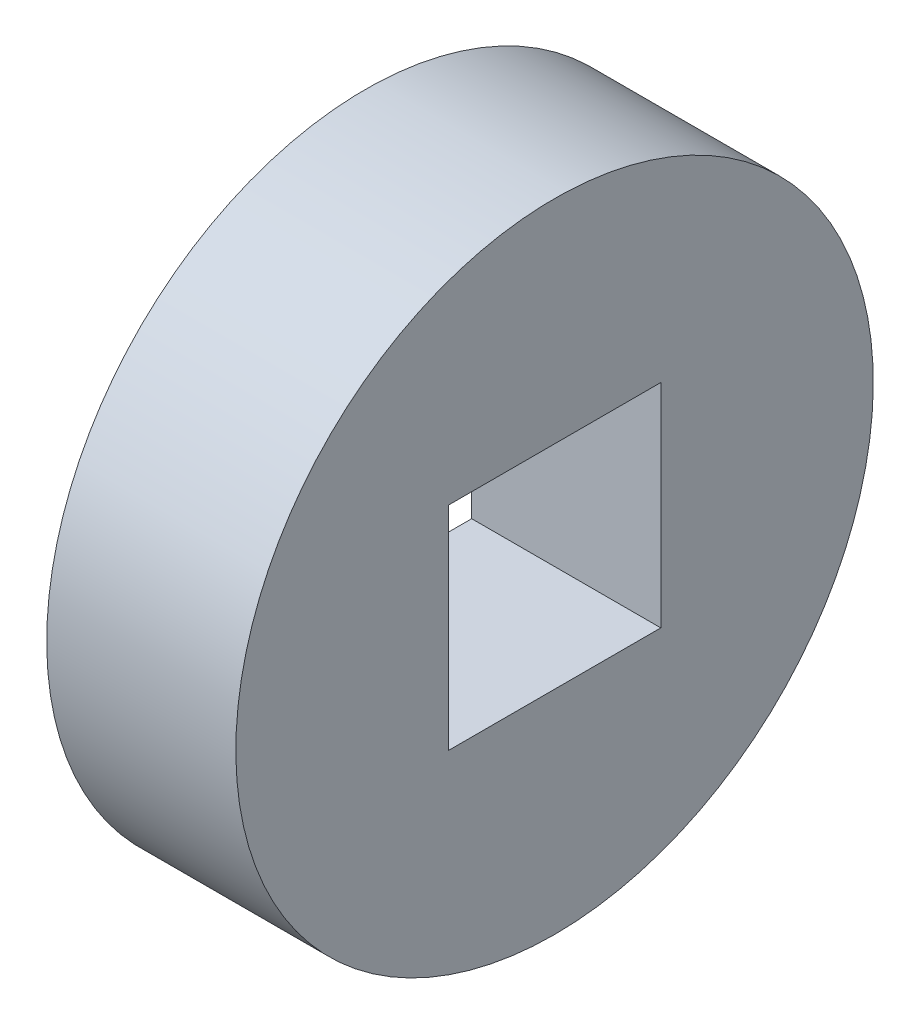
ISO-10303-21;
HEADER;
FILE_DESCRIPTION(('STEP AP214'),'2;1');
FILE_NAME('part.step','',(''),(''),'','','');
FILE_SCHEMA(('AUTOMOTIVE_DESIGN { 1 0 10303 214 1 1 1 1 }'));
ENDSEC;
DATA;
#1=APPLICATION_CONTEXT('core data for automotive mechanical design processes');
#2=APPLICATION_PROTOCOL_DEFINITION('international standard','automotive_design',2000,#1);
#3=PRODUCT_CONTEXT('',#1,'mechanical');
#4=PRODUCT('Part','Part','',(#3));
#5=PRODUCT_RELATED_PRODUCT_CATEGORY('part','',(#4));
#6=PRODUCT_DEFINITION_FORMATION('','',#4);
#7=PRODUCT_DEFINITION_CONTEXT('part definition',#1,'design');
#8=PRODUCT_DEFINITION('design','',#6,#7);
#9=PRODUCT_DEFINITION_SHAPE('','',#8);
#10=(LENGTH_UNIT() NAMED_UNIT(*) SI_UNIT(.MILLI.,.METRE.));
#11=(NAMED_UNIT(*) PLANE_ANGLE_UNIT() SI_UNIT($,.RADIAN.));
#12=(NAMED_UNIT(*) SI_UNIT($,.STERADIAN.) SOLID_ANGLE_UNIT());
#13=UNCERTAINTY_MEASURE_WITH_UNIT(LENGTH_MEASURE(1.E-05),#10,'distance_accuracy_value','');
#14=(GEOMETRIC_REPRESENTATION_CONTEXT(3) GLOBAL_UNCERTAINTY_ASSIGNED_CONTEXT((#13)) GLOBAL_UNIT_ASSIGNED_CONTEXT((#10,
#11,#12)) REPRESENTATION_CONTEXT('',''));
#15=CARTESIAN_POINT('',(0.,0.,0.));
#16=DIRECTION('',(0.,0.,1.));
#17=DIRECTION('',(1.,0.,0.));
#18=AXIS2_PLACEMENT_3D('',#15,#16,#17);
#19=CARTESIAN_POINT('',(-176.403,0.,1704.975));
#20=DIRECTION('',(0.,0.,1.));
#21=DIRECTION('',(1.,0.,0.));
#22=AXIS2_PLACEMENT_3D('',#19,#20,#21);
#23=PLANE('',#22);
#24=DIRECTION('',(0.,-1.,0.));
#25=VECTOR('',#24,1.);
#26=CARTESIAN_POINT('',(-165.1,0.,1704.975));
#27=LINE('',#26,#25);
#28=CARTESIAN_POINT('',(-165.1,6.34999999999989,1704.975));
#29=VERTEX_POINT('',#28);
#30=CARTESIAN_POINT('',(-165.1,-6.35000000000012,1704.975));
#31=VERTEX_POINT('',#30);
#32=EDGE_CURVE('E111',#29,#31,#27,.T.);
#33=ORIENTED_EDGE('',*,*,#32,.F.);
#34=DIRECTION('',(1.,0.,0.));
#35=VECTOR('',#34,1.);
#36=CARTESIAN_POINT('',(-176.403,6.34999999999989,1704.975));
#37=LINE('',#36,#35);
#38=CARTESIAN_POINT('',(-176.403,6.34999999999989,1704.975));
#39=VERTEX_POINT('',#38);
#40=EDGE_CURVE('E11',#39,#29,#37,.T.);
#41=ORIENTED_EDGE('',*,*,#40,.F.);
#42=DIRECTION('',(0.,-1.,0.));
#43=VECTOR('',#42,1.);
#44=CARTESIAN_POINT('',(-176.403,0.,1704.975));
#45=LINE('',#44,#43);
#46=CARTESIAN_POINT('',(-176.403,-6.35000000000012,1704.975));
#47=VERTEX_POINT('',#46);
#48=EDGE_CURVE('E94',#39,#47,#45,.T.);
#49=ORIENTED_EDGE('',*,*,#48,.T.);
#50=DIRECTION('',(1.,0.,0.));
#51=VECTOR('',#50,1.);
#52=CARTESIAN_POINT('',(-176.403,-6.35000000000012,1704.975));
#53=LINE('',#52,#51);
#54=EDGE_CURVE('E70',#47,#31,#53,.T.);
#55=ORIENTED_EDGE('',*,*,#54,.T.);
#56=EDGE_LOOP('',(#33,#41,#49,#55));
#57=FACE_BOUND('',#56,.T.);
#58=ADVANCED_FACE('F16',(#57),#23,.T.);
#59=CARTESIAN_POINT('',(-176.403,6.34999999999988,1714.83011894226));
#60=DIRECTION('',(0.,-1.,0.));
#61=DIRECTION('',(0.,0.,-1.));
#62=AXIS2_PLACEMENT_3D('',#59,#60,#61);
#63=PLANE('',#62);
#64=DIRECTION('',(0.,0.,-1.));
#65=VECTOR('',#64,1.);
#66=CARTESIAN_POINT('',(-165.1,6.34999999999988,1714.83011894226));
#67=LINE('',#66,#65);
#68=CARTESIAN_POINT('',(-165.1,6.34999999999988,1717.675));
#69=VERTEX_POINT('',#68);
#70=EDGE_CURVE('E84',#69,#29,#67,.T.);
#71=ORIENTED_EDGE('',*,*,#70,.F.);
#72=DIRECTION('',(1.,0.,0.));
#73=VECTOR('',#72,1.);
#74=CARTESIAN_POINT('',(-176.403,6.34999999999988,1717.675));
#75=LINE('',#74,#73);
#76=CARTESIAN_POINT('',(-176.403,6.34999999999988,1717.675));
#77=VERTEX_POINT('',#76);
#78=EDGE_CURVE('E26',#77,#69,#75,.T.);
#79=ORIENTED_EDGE('',*,*,#78,.F.);
#80=DIRECTION('',(0.,0.,-1.));
#81=VECTOR('',#80,1.);
#82=CARTESIAN_POINT('',(-176.403,6.34999999999988,1714.83011894226));
#83=LINE('',#82,#81);
#84=EDGE_CURVE('E82',#77,#39,#83,.T.);
#85=ORIENTED_EDGE('',*,*,#84,.T.);
#86=ORIENTED_EDGE('',*,*,#40,.T.);
#87=EDGE_LOOP('',(#71,#79,#85,#86));
#88=FACE_BOUND('',#87,.T.);
#89=ADVANCED_FACE('F80',(#88),#63,.T.);
#90=CARTESIAN_POINT('',(-176.403,-2.90317127257596,1717.675));
#91=DIRECTION('',(0.,0.,1.));
#92=DIRECTION('',(1.,0.,0.));
#93=AXIS2_PLACEMENT_3D('',#90,#91,#92);
#94=PLANE('',#93);
#95=DIRECTION('',(0.,-1.,0.));
#96=VECTOR('',#95,1.);
#97=CARTESIAN_POINT('',(-165.1,-2.90317127257596,1717.675));
#98=LINE('',#97,#96);
#99=CARTESIAN_POINT('',(-165.1,-6.35000000000012,1717.675));
#100=VERTEX_POINT('',#99);
#101=EDGE_CURVE('E115',#69,#100,#98,.T.);
#102=ORIENTED_EDGE('',*,*,#101,.T.);
#103=DIRECTION('',(1.,0.,0.));
#104=VECTOR('',#103,1.);
#105=CARTESIAN_POINT('',(-176.403,-6.35000000000012,1717.675));
#106=LINE('',#105,#104);
#107=CARTESIAN_POINT('',(-176.403,-6.35000000000012,1717.675));
#108=VERTEX_POINT('',#107);
#109=EDGE_CURVE('E87',#108,#100,#106,.T.);
#110=ORIENTED_EDGE('',*,*,#109,.F.);
#111=DIRECTION('',(0.,-1.,0.));
#112=VECTOR('',#111,1.);
#113=CARTESIAN_POINT('',(-176.403,-2.90317127257596,1717.675));
#114=LINE('',#113,#112);
#115=EDGE_CURVE('E89',#77,#108,#114,.T.);
#116=ORIENTED_EDGE('',*,*,#115,.F.);
#117=ORIENTED_EDGE('',*,*,#78,.T.);
#118=EDGE_LOOP('',(#102,#110,#116,#117));
#119=FACE_BOUND('',#118,.T.);
#120=ADVANCED_FACE('F90',(#119),#94,.F.);
#121=CARTESIAN_POINT('',(-176.403,0.,1711.325));
#122=DIRECTION('',(1.,0.,0.));
#123=DIRECTION('',(0.,0.,-1.));
#124=AXIS2_PLACEMENT_3D('',#121,#122,#123);
#125=CYLINDRICAL_SURFACE('',#124,19.05);
#126=CARTESIAN_POINT('',(-176.403,0.,1711.325));
#127=DIRECTION('',(-1.,0.,0.));
#128=DIRECTION('',(0.,-1.,0.));
#129=AXIS2_PLACEMENT_3D('',#126,#127,#128);
#130=CIRCLE('',#129,19.05);
#131=CARTESIAN_POINT('',(-176.403,-19.0500000000001,1711.325));
#132=VERTEX_POINT('',#131);
#133=EDGE_CURVE('E101',#132,#132,#130,.T.);
#134=ORIENTED_EDGE('',*,*,#133,.F.);
#135=EDGE_LOOP('',(#134));
#136=FACE_BOUND('',#135,.T.);
#137=CARTESIAN_POINT('',(-165.1,0.,1711.325));
#138=DIRECTION('',(-1.,0.,0.));
#139=DIRECTION('',(0.,-1.,0.));
#140=AXIS2_PLACEMENT_3D('',#137,#138,#139);
#141=CIRCLE('',#140,19.05);
#142=CARTESIAN_POINT('',(-165.1,-19.0500000000001,1711.325));
#143=VERTEX_POINT('',#142);
#144=EDGE_CURVE('E107',#143,#143,#141,.T.);
#145=ORIENTED_EDGE('',*,*,#144,.T.);
#146=EDGE_LOOP('',(#145));
#147=FACE_BOUND('',#146,.T.);
#148=ADVANCED_FACE('F18',(#136,#147),#125,.T.);
#149=CARTESIAN_POINT('',(-176.403,-6.35000000000012,1714.83011894226));
#150=DIRECTION('',(0.,-1.,0.));
#151=DIRECTION('',(0.,0.,-1.));
#152=AXIS2_PLACEMENT_3D('',#149,#150,#151);
#153=PLANE('',#152);
#154=DIRECTION('',(0.,0.,-1.));
#155=VECTOR('',#154,1.);
#156=CARTESIAN_POINT('',(-165.1,-6.35000000000012,1714.83011894226));
#157=LINE('',#156,#155);
#158=EDGE_CURVE('E61',#100,#31,#157,.T.);
#159=ORIENTED_EDGE('',*,*,#158,.T.);
#160=ORIENTED_EDGE('',*,*,#54,.F.);
#161=DIRECTION('',(0.,0.,-1.));
#162=VECTOR('',#161,1.);
#163=CARTESIAN_POINT('',(-176.403,-6.35000000000012,1714.83011894226));
#164=LINE('',#163,#162);
#165=EDGE_CURVE('E39',#108,#47,#164,.T.);
#166=ORIENTED_EDGE('',*,*,#165,.F.);
#167=ORIENTED_EDGE('',*,*,#109,.T.);
#168=EDGE_LOOP('',(#159,#160,#166,#167));
#169=FACE_BOUND('',#168,.T.);
#170=ADVANCED_FACE('F124',(#169),#153,.F.);
#171=CARTESIAN_POINT('',(-176.403,0.,1711.325));
#172=DIRECTION('',(-1.,0.,0.));
#173=DIRECTION('',(0.,-1.,0.));
#174=AXIS2_PLACEMENT_3D('',#171,#172,#173);
#175=PLANE('',#174);
#176=ORIENTED_EDGE('',*,*,#133,.T.);
#177=EDGE_LOOP('',(#176));
#178=FACE_BOUND('',#177,.T.);
#179=ORIENTED_EDGE('',*,*,#48,.F.);
#180=ORIENTED_EDGE('',*,*,#84,.F.);
#181=ORIENTED_EDGE('',*,*,#115,.T.);
#182=ORIENTED_EDGE('',*,*,#165,.T.);
#183=EDGE_LOOP('',(#179,#180,#181,#182));
#184=FACE_BOUND('',#183,.T.);
#185=ADVANCED_FACE('F93',(#178,#184),#175,.T.);
#186=CARTESIAN_POINT('',(-165.1,0.,1711.325));
#187=DIRECTION('',(-1.,0.,0.));
#188=DIRECTION('',(0.,-1.,0.));
#189=AXIS2_PLACEMENT_3D('',#186,#187,#188);
#190=PLANE('',#189);
#191=ORIENTED_EDGE('',*,*,#144,.F.);
#192=EDGE_LOOP('',(#191));
#193=FACE_BOUND('',#192,.T.);
#194=ORIENTED_EDGE('',*,*,#32,.T.);
#195=ORIENTED_EDGE('',*,*,#158,.F.);
#196=ORIENTED_EDGE('',*,*,#101,.F.);
#197=ORIENTED_EDGE('',*,*,#70,.T.);
#198=EDGE_LOOP('',(#194,#195,#196,#197));
#199=FACE_BOUND('',#198,.T.);
#200=ADVANCED_FACE('F125',(#193,#199),#190,.F.);
#201=CLOSED_SHELL('',(#58,#89,#120,#148,#170,#185,#200));
#202=MANIFOLD_SOLID_BREP('B1',#201);
#203=ADVANCED_BREP_SHAPE_REPRESENTATION('',(#18,#202),#14);
#204=SHAPE_DEFINITION_REPRESENTATION(#9,#203);
ENDSEC;
END-ISO-10303-21;
